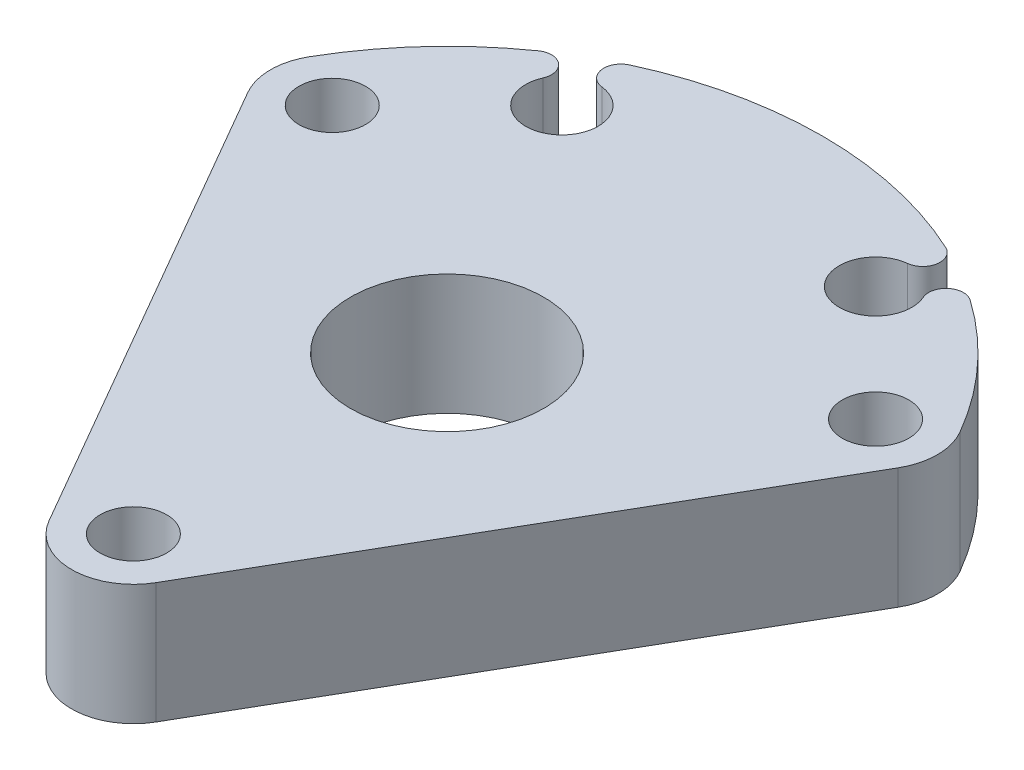
ISO-10303-21;
HEADER;
FILE_DESCRIPTION(('STEP AP214'),'2;1');
FILE_NAME('part.step','',(''),(''),'','','');
FILE_SCHEMA(('AUTOMOTIVE_DESIGN { 1 0 10303 214 1 1 1 1 }'));
ENDSEC;
DATA;
#1=APPLICATION_CONTEXT('core data for automotive mechanical design processes');
#2=APPLICATION_PROTOCOL_DEFINITION('international standard','automotive_design',2000,#1);
#3=PRODUCT_CONTEXT('',#1,'mechanical');
#4=PRODUCT('Part','Part','',(#3));
#5=PRODUCT_RELATED_PRODUCT_CATEGORY('part','',(#4));
#6=PRODUCT_DEFINITION_FORMATION('','',#4);
#7=PRODUCT_DEFINITION_CONTEXT('part definition',#1,'design');
#8=PRODUCT_DEFINITION('design','',#6,#7);
#9=PRODUCT_DEFINITION_SHAPE('','',#8);
#10=(LENGTH_UNIT() NAMED_UNIT(*) SI_UNIT(.MILLI.,.METRE.));
#11=(NAMED_UNIT(*) PLANE_ANGLE_UNIT() SI_UNIT($,.RADIAN.));
#12=(NAMED_UNIT(*) SI_UNIT($,.STERADIAN.) SOLID_ANGLE_UNIT());
#13=UNCERTAINTY_MEASURE_WITH_UNIT(LENGTH_MEASURE(1.E-05),#10,'distance_accuracy_value','');
#14=(GEOMETRIC_REPRESENTATION_CONTEXT(3) GLOBAL_UNCERTAINTY_ASSIGNED_CONTEXT((#13)) GLOBAL_UNIT_ASSIGNED_CONTEXT((#10,
#11,#12)) REPRESENTATION_CONTEXT('',''));
#15=CARTESIAN_POINT('',(0.,0.,0.));
#16=DIRECTION('',(0.,0.,1.));
#17=DIRECTION('',(1.,0.,0.));
#18=AXIS2_PLACEMENT_3D('',#15,#16,#17);
#19=CARTESIAN_POINT('',(0.,6.35,0.));
#20=DIRECTION('',(0.,-1.,0.));
#21=DIRECTION('',(0.,0.,-1.));
#22=AXIS2_PLACEMENT_3D('',#19,#20,#21);
#23=CYLINDRICAL_SURFACE('',#22,19.75);
#24=DIRECTION('',(0.,1.,0.));
#25=VECTOR('',#24,1.);
#26=CARTESIAN_POINT('',(-11.3545625208397,0.,-16.1597156522119));
#27=LINE('',#26,#25);
#28=CARTESIAN_POINT('',(-11.3545625208397,0.,-16.1597156522119));
#29=VERTEX_POINT('',#28);
#30=CARTESIAN_POINT('',(-11.3545625208397,6.35,-16.1597156522119));
#31=VERTEX_POINT('',#30);
#32=EDGE_CURVE('E148',#29,#31,#27,.T.);
#33=ORIENTED_EDGE('',*,*,#32,.F.);
#34=CARTESIAN_POINT('',(0.,0.,0.));
#35=DIRECTION('',(0.,1.,0.));
#36=DIRECTION('',(0.,0.,1.));
#37=AXIS2_PLACEMENT_3D('',#34,#35,#36);
#38=CIRCLE('',#37,19.75);
#39=CARTESIAN_POINT('',(-17.1040017247427,0.,-9.87500000000001));
#40=VERTEX_POINT('',#39);
#41=EDGE_CURVE('E162',#29,#40,#38,.T.);
#42=ORIENTED_EDGE('',*,*,#41,.T.);
#43=DIRECTION('',(0.,-1.,0.));
#44=VECTOR('',#43,1.);
#45=CARTESIAN_POINT('',(-17.1040017247427,6.35,-9.87500000000001));
#46=LINE('',#45,#44);
#47=CARTESIAN_POINT('',(-17.1040017247427,6.35,-9.87500000000001));
#48=VERTEX_POINT('',#47);
#49=EDGE_CURVE('E45',#48,#40,#46,.T.);
#50=ORIENTED_EDGE('',*,*,#49,.F.);
#51=CARTESIAN_POINT('',(0.,6.35,0.));
#52=DIRECTION('',(0.,1.,0.));
#53=DIRECTION('',(0.,0.,1.));
#54=AXIS2_PLACEMENT_3D('',#51,#52,#53);
#55=CIRCLE('',#54,19.75);
#56=EDGE_CURVE('E224',#31,#48,#55,.T.);
#57=ORIENTED_EDGE('',*,*,#56,.F.);
#58=EDGE_LOOP('',(#33,#42,#50,#57));
#59=FACE_BOUND('',#58,.T.);
#60=ADVANCED_FACE('F37',(#59),#23,.T.);
#61=CARTESIAN_POINT('',(8.3174430123287,0.,-17.9131974180118));
#62=VERTEX_POINT('',#61);
#63=CARTESIAN_POINT('',(-8.31744301232875,0.,-17.9131974180118));
#64=VERTEX_POINT('',#63);
#65=EDGE_CURVE('E154',#62,#64,#38,.T.);
#66=ORIENTED_EDGE('',*,*,#65,.T.);
#67=DIRECTION('',(0.,1.,0.));
#68=VECTOR('',#67,1.);
#69=CARTESIAN_POINT('',(-8.31744301232875,0.,-17.9131974180118));
#70=LINE('',#69,#68);
#71=CARTESIAN_POINT('',(-8.31744301232875,6.35,-17.9131974180118));
#72=VERTEX_POINT('',#71);
#73=EDGE_CURVE('E138',#64,#72,#70,.T.);
#74=ORIENTED_EDGE('',*,*,#73,.T.);
#75=CARTESIAN_POINT('',(8.3174430123287,6.35,-17.9131974180118));
#76=VERTEX_POINT('',#75);
#77=EDGE_CURVE('E223',#76,#72,#55,.T.);
#78=ORIENTED_EDGE('',*,*,#77,.F.);
#79=DIRECTION('',(0.,1.,0.));
#80=VECTOR('',#79,1.);
#81=CARTESIAN_POINT('',(8.3174430123287,0.,-17.9131974180118));
#82=LINE('',#81,#80);
#83=EDGE_CURVE('E160',#62,#76,#82,.T.);
#84=ORIENTED_EDGE('',*,*,#83,.F.);
#85=EDGE_LOOP('',(#66,#74,#78,#84));
#86=FACE_BOUND('',#85,.T.);
#87=ADVANCED_FACE('F159',(#86),#23,.T.);
#88=CARTESIAN_POINT('',(14.2894191624432,6.35,-8.25));
#89=DIRECTION('',(0.,1.,0.));
#90=DIRECTION('',(0.,0.,1.));
#91=AXIS2_PLACEMENT_3D('',#88,#89,#90);
#92=PLANE('',#91);
#93=CARTESIAN_POINT('',(-7.93394264831238,6.35,-17.0872563541149));
#94=DIRECTION('',(0.,-1.,0.));
#95=DIRECTION('',(0.86602540378444,0.,0.499999999999998));
#96=AXIS2_PLACEMENT_3D('',#93,#94,#95);
#97=CIRCLE('',#96,0.910632291450181);
#98=CARTESIAN_POINT('',(-8.03616197264354,6.35,-16.1823793569683));
#99=VERTEX_POINT('',#98);
#100=EDGE_CURVE('E143',#99,#72,#97,.T.);
#101=ORIENTED_EDGE('',*,*,#100,.F.);
#102=CARTESIAN_POINT('',(-8.25000000000003,6.35,-14.2894191624432));
#103=DIRECTION('',(0.,1.,0.));
#104=DIRECTION('',(0.86602540378444,0.,0.499999999999998));
#105=AXIS2_PLACEMENT_3D('',#102,#103,#104);
#106=CIRCLE('',#105,1.905);
#107=CARTESIAN_POINT('',(-9.99627063048971,6.35,-15.0507100957199));
#108=VERTEX_POINT('',#107);
#109=EDGE_CURVE('E157',#108,#99,#106,.T.);
#110=ORIENTED_EDGE('',*,*,#109,.F.);
#111=CARTESIAN_POINT('',(-10.8310267594844,6.35,-15.4146240626647));
#112=DIRECTION('',(0.,-1.,0.));
#113=DIRECTION('',(-0.86602540378444,0.,-0.499999999999998));
#114=AXIS2_PLACEMENT_3D('',#111,#112,#113);
#115=CIRCLE('',#114,0.910632291450179);
#116=EDGE_CURVE('E281',#31,#108,#115,.T.);
#117=ORIENTED_EDGE('',*,*,#116,.F.);
#118=ORIENTED_EDGE('',*,*,#56,.T.);
#119=CARTESIAN_POINT('',(-14.2894191624432,6.35,-8.25));
#120=DIRECTION('',(0.,1.,0.));
#121=DIRECTION('',(0.,0.,1.));
#122=AXIS2_PLACEMENT_3D('',#119,#120,#121);
#123=CIRCLE('',#122,3.25);
#124=CARTESIAN_POINT('',(-17.1040017247427,6.35,-6.625));
#125=VERTEX_POINT('',#124);
#126=EDGE_CURVE('E197',#48,#125,#123,.T.);
#127=ORIENTED_EDGE('',*,*,#126,.T.);
#128=DIRECTION('',(0.5,0.,0.866025403784438));
#129=VECTOR('',#128,1.);
#130=CARTESIAN_POINT('',(-17.1040017247427,6.35,-6.625));
#131=LINE('',#130,#129);
#132=CARTESIAN_POINT('',(-2.81458256229942,6.35,18.125));
#133=VERTEX_POINT('',#132);
#134=EDGE_CURVE('E215',#125,#133,#131,.T.);
#135=ORIENTED_EDGE('',*,*,#134,.T.);
#136=CARTESIAN_POINT('',(0.,6.35,16.5));
#137=DIRECTION('',(0.,1.,0.));
#138=DIRECTION('',(0.,0.,1.));
#139=AXIS2_PLACEMENT_3D('',#136,#137,#138);
#140=CIRCLE('',#139,3.25);
#141=CARTESIAN_POINT('',(2.81458256229942,6.35,18.125));
#142=VERTEX_POINT('',#141);
#143=EDGE_CURVE('E212',#133,#142,#140,.T.);
#144=ORIENTED_EDGE('',*,*,#143,.T.);
#145=DIRECTION('',(0.5,0.,-0.866025403784438));
#146=VECTOR('',#145,1.);
#147=CARTESIAN_POINT('',(2.81458256229942,6.35,18.125));
#148=LINE('',#147,#146);
#149=CARTESIAN_POINT('',(17.1040017247427,6.35,-6.625));
#150=VERTEX_POINT('',#149);
#151=EDGE_CURVE('E182',#142,#150,#148,.T.);
#152=ORIENTED_EDGE('',*,*,#151,.T.);
#153=CARTESIAN_POINT('',(14.2894191624432,6.35,-8.25));
#154=DIRECTION('',(0.,1.,0.));
#155=DIRECTION('',(0.,0.,1.));
#156=AXIS2_PLACEMENT_3D('',#153,#154,#155);
#157=CIRCLE('',#156,3.25);
#158=CARTESIAN_POINT('',(17.1040017247427,6.35,-9.875));
#159=VERTEX_POINT('',#158);
#160=EDGE_CURVE('E177',#150,#159,#157,.T.);
#161=ORIENTED_EDGE('',*,*,#160,.T.);
#162=CARTESIAN_POINT('',(11.3545625208397,6.35,-16.1597156522119));
#163=VERTEX_POINT('',#162);
#164=EDGE_CURVE('E220',#159,#163,#55,.T.);
#165=ORIENTED_EDGE('',*,*,#164,.T.);
#166=CARTESIAN_POINT('',(10.8310267594844,6.35,-15.4146240626647));
#167=DIRECTION('',(0.,-1.,0.));
#168=DIRECTION('',(0.,0.,1.));
#169=AXIS2_PLACEMENT_3D('',#166,#167,#168);
#170=CIRCLE('',#169,0.910632291450181);
#171=CARTESIAN_POINT('',(9.99627063048967,6.35,-15.0507100957199));
#172=VERTEX_POINT('',#171);
#173=EDGE_CURVE('E267',#172,#163,#170,.T.);
#174=ORIENTED_EDGE('',*,*,#173,.F.);
#175=CARTESIAN_POINT('',(8.25,6.35,-14.2894191624432));
#176=DIRECTION('',(0.,1.,0.));
#177=DIRECTION('',(0.,0.,1.));
#178=AXIS2_PLACEMENT_3D('',#175,#176,#177);
#179=CIRCLE('',#178,1.905);
#180=CARTESIAN_POINT('',(8.03616197264349,6.35,-16.1823793569683));
#181=VERTEX_POINT('',#180);
#182=EDGE_CURVE('E260',#181,#172,#179,.T.);
#183=ORIENTED_EDGE('',*,*,#182,.F.);
#184=CARTESIAN_POINT('',(7.93394264831234,6.35,-17.0872563541149));
#185=DIRECTION('',(0.,-1.,0.));
#186=DIRECTION('',(0.,0.,-1.));
#187=AXIS2_PLACEMENT_3D('',#184,#185,#186);
#188=CIRCLE('',#187,0.910632291450179);
#189=EDGE_CURVE('E264',#76,#181,#188,.T.);
#190=ORIENTED_EDGE('',*,*,#189,.F.);
#191=ORIENTED_EDGE('',*,*,#77,.T.);
#192=EDGE_LOOP('',(#101,#110,#117,#118,#127,#135,#144,#152,#161,#165,#174,#183,#190,#191));
#193=FACE_BOUND('',#192,.T.);
#194=CARTESIAN_POINT('',(0.,6.35,16.5));
#195=DIRECTION('',(0.,1.,0.));
#196=DIRECTION('',(0.,0.,1.));
#197=AXIS2_PLACEMENT_3D('',#194,#195,#196);
#198=CIRCLE('',#197,1.75);
#199=CARTESIAN_POINT('',(0.,6.35,18.25));
#200=VERTEX_POINT('',#199);
#201=EDGE_CURVE('E237',#200,#200,#198,.T.);
#202=ORIENTED_EDGE('',*,*,#201,.F.);
#203=EDGE_LOOP('',(#202));
#204=FACE_BOUND('',#203,.T.);
#205=CARTESIAN_POINT('',(0.,6.35,0.));
#206=DIRECTION('',(0.,1.,0.));
#207=DIRECTION('',(0.,0.,1.));
#208=AXIS2_PLACEMENT_3D('',#205,#206,#207);
#209=CIRCLE('',#208,5.08);
#210=CARTESIAN_POINT('',(0.,6.35,5.08));
#211=VERTEX_POINT('',#210);
#212=EDGE_CURVE('E230',#211,#211,#209,.T.);
#213=ORIENTED_EDGE('',*,*,#212,.F.);
#214=EDGE_LOOP('',(#213));
#215=FACE_BOUND('',#214,.T.);
#216=CARTESIAN_POINT('',(-14.2894191624432,6.35,-8.25));
#217=DIRECTION('',(0.,1.,0.));
#218=DIRECTION('',(0.,0.,1.));
#219=AXIS2_PLACEMENT_3D('',#216,#217,#218);
#220=CIRCLE('',#219,1.75);
#221=CARTESIAN_POINT('',(-14.2894191624432,6.35,-6.5));
#222=VERTEX_POINT('',#221);
#223=EDGE_CURVE('E231',#222,#222,#220,.T.);
#224=ORIENTED_EDGE('',*,*,#223,.F.);
#225=EDGE_LOOP('',(#224));
#226=FACE_BOUND('',#225,.T.);
#227=CARTESIAN_POINT('',(14.2894191624432,6.35,-8.25));
#228=DIRECTION('',(0.,1.,0.));
#229=DIRECTION('',(0.,0.,1.));
#230=AXIS2_PLACEMENT_3D('',#227,#228,#229);
#231=CIRCLE('',#230,1.75);
#232=CARTESIAN_POINT('',(14.2894191624432,6.35,-6.5));
#233=VERTEX_POINT('',#232);
#234=EDGE_CURVE('E243',#233,#233,#231,.T.);
#235=ORIENTED_EDGE('',*,*,#234,.F.);
#236=EDGE_LOOP('',(#235));
#237=FACE_BOUND('',#236,.T.);
#238=ADVANCED_FACE('F291',(#193,#204,#215,#226,#237),#92,.T.);
#239=CARTESIAN_POINT('',(14.2894191624432,0.,-8.25));
#240=DIRECTION('',(0.,1.,0.));
#241=DIRECTION('',(0.,0.,1.));
#242=AXIS2_PLACEMENT_3D('',#239,#240,#241);
#243=PLANE('',#242);
#244=CARTESIAN_POINT('',(0.,0.,16.5));
#245=DIRECTION('',(0.,1.,0.));
#246=DIRECTION('',(0.,0.,1.));
#247=AXIS2_PLACEMENT_3D('',#244,#245,#246);
#248=CIRCLE('',#247,1.75);
#249=CARTESIAN_POINT('',(0.,0.,18.25));
#250=VERTEX_POINT('',#249);
#251=EDGE_CURVE('E240',#250,#250,#248,.T.);
#252=ORIENTED_EDGE('',*,*,#251,.T.);
#253=EDGE_LOOP('',(#252));
#254=FACE_BOUND('',#253,.T.);
#255=CARTESIAN_POINT('',(0.,0.,0.));
#256=DIRECTION('',(0.,1.,0.));
#257=DIRECTION('',(0.,0.,1.));
#258=AXIS2_PLACEMENT_3D('',#255,#256,#257);
#259=CIRCLE('',#258,5.08);
#260=CARTESIAN_POINT('',(0.,0.,5.08));
#261=VERTEX_POINT('',#260);
#262=EDGE_CURVE('E227',#261,#261,#259,.T.);
#263=ORIENTED_EDGE('',*,*,#262,.T.);
#264=EDGE_LOOP('',(#263));
#265=FACE_BOUND('',#264,.T.);
#266=CARTESIAN_POINT('',(-8.25000000000003,0.,-14.2894191624432));
#267=DIRECTION('',(0.,1.,0.));
#268=DIRECTION('',(0.86602540378444,0.,0.499999999999998));
#269=AXIS2_PLACEMENT_3D('',#266,#267,#268);
#270=CIRCLE('',#269,1.905);
#271=CARTESIAN_POINT('',(-9.99627063048971,0.,-15.0507100957199));
#272=VERTEX_POINT('',#271);
#273=CARTESIAN_POINT('',(-8.03616197264354,0.,-16.1823793569683));
#274=VERTEX_POINT('',#273);
#275=EDGE_CURVE('E52',#272,#274,#270,.T.);
#276=ORIENTED_EDGE('',*,*,#275,.T.);
#277=CARTESIAN_POINT('',(-7.93394264831238,0.,-17.0872563541149));
#278=DIRECTION('',(0.,-1.,0.));
#279=DIRECTION('',(0.86602540378444,0.,0.499999999999998));
#280=AXIS2_PLACEMENT_3D('',#277,#278,#279);
#281=CIRCLE('',#280,0.910632291450181);
#282=EDGE_CURVE('E141',#274,#64,#281,.T.);
#283=ORIENTED_EDGE('',*,*,#282,.T.);
#284=ORIENTED_EDGE('',*,*,#65,.F.);
#285=CARTESIAN_POINT('',(7.93394264831234,0.,-17.0872563541149));
#286=DIRECTION('',(0.,-1.,0.));
#287=DIRECTION('',(0.,0.,-1.));
#288=AXIS2_PLACEMENT_3D('',#285,#286,#287);
#289=CIRCLE('',#288,0.910632291450179);
#290=CARTESIAN_POINT('',(8.03616197264349,0.,-16.1823793569683));
#291=VERTEX_POINT('',#290);
#292=EDGE_CURVE('E60',#62,#291,#289,.T.);
#293=ORIENTED_EDGE('',*,*,#292,.T.);
#294=CARTESIAN_POINT('',(8.25,0.,-14.2894191624432));
#295=DIRECTION('',(0.,1.,0.));
#296=DIRECTION('',(0.,0.,1.));
#297=AXIS2_PLACEMENT_3D('',#294,#295,#296);
#298=CIRCLE('',#297,1.905);
#299=CARTESIAN_POINT('',(9.99627063048967,0.,-15.0507100957199));
#300=VERTEX_POINT('',#299);
#301=EDGE_CURVE('E255',#291,#300,#298,.T.);
#302=ORIENTED_EDGE('',*,*,#301,.T.);
#303=CARTESIAN_POINT('',(10.8310267594844,0.,-15.4146240626647));
#304=DIRECTION('',(0.,-1.,0.));
#305=DIRECTION('',(0.,0.,1.));
#306=AXIS2_PLACEMENT_3D('',#303,#304,#305);
#307=CIRCLE('',#306,0.910632291450181);
#308=CARTESIAN_POINT('',(11.3545625208397,0.,-16.1597156522119));
#309=VERTEX_POINT('',#308);
#310=EDGE_CURVE('E263',#300,#309,#307,.T.);
#311=ORIENTED_EDGE('',*,*,#310,.T.);
#312=CARTESIAN_POINT('',(17.1040017247427,0.,-9.875));
#313=VERTEX_POINT('',#312);
#314=EDGE_CURVE('E161',#313,#309,#38,.T.);
#315=ORIENTED_EDGE('',*,*,#314,.F.);
#316=CARTESIAN_POINT('',(14.2894191624432,0.,-8.25));
#317=DIRECTION('',(0.,1.,0.));
#318=DIRECTION('',(0.,0.,1.));
#319=AXIS2_PLACEMENT_3D('',#316,#317,#318);
#320=CIRCLE('',#319,3.25);
#321=CARTESIAN_POINT('',(17.1040017247427,0.,-6.625));
#322=VERTEX_POINT('',#321);
#323=EDGE_CURVE('E166',#322,#313,#320,.T.);
#324=ORIENTED_EDGE('',*,*,#323,.F.);
#325=DIRECTION('',(0.5,0.,-0.866025403784438));
#326=VECTOR('',#325,1.);
#327=CARTESIAN_POINT('',(2.81458256229942,0.,18.125));
#328=LINE('',#327,#326);
#329=CARTESIAN_POINT('',(2.81458256229942,0.,18.125));
#330=VERTEX_POINT('',#329);
#331=EDGE_CURVE('E175',#330,#322,#328,.T.);
#332=ORIENTED_EDGE('',*,*,#331,.F.);
#333=CARTESIAN_POINT('',(0.,0.,16.5));
#334=DIRECTION('',(0.,1.,0.));
#335=DIRECTION('',(0.,0.,1.));
#336=AXIS2_PLACEMENT_3D('',#333,#334,#335);
#337=CIRCLE('',#336,3.25);
#338=CARTESIAN_POINT('',(-2.81458256229942,0.,18.125));
#339=VERTEX_POINT('',#338);
#340=EDGE_CURVE('E173',#339,#330,#337,.T.);
#341=ORIENTED_EDGE('',*,*,#340,.F.);
#342=DIRECTION('',(0.5,0.,0.866025403784438));
#343=VECTOR('',#342,1.);
#344=CARTESIAN_POINT('',(-17.1040017247427,0.,-6.625));
#345=LINE('',#344,#343);
#346=CARTESIAN_POINT('',(-17.1040017247427,0.,-6.625));
#347=VERTEX_POINT('',#346);
#348=EDGE_CURVE('E171',#347,#339,#345,.T.);
#349=ORIENTED_EDGE('',*,*,#348,.F.);
#350=CARTESIAN_POINT('',(-14.2894191624432,0.,-8.25));
#351=DIRECTION('',(0.,1.,0.));
#352=DIRECTION('',(0.,0.,1.));
#353=AXIS2_PLACEMENT_3D('',#350,#351,#352);
#354=CIRCLE('',#353,3.25);
#355=EDGE_CURVE('E165',#40,#347,#354,.T.);
#356=ORIENTED_EDGE('',*,*,#355,.F.);
#357=ORIENTED_EDGE('',*,*,#41,.F.);
#358=CARTESIAN_POINT('',(-10.8310267594844,0.,-15.4146240626647));
#359=DIRECTION('',(0.,-1.,0.));
#360=DIRECTION('',(-0.86602540378444,0.,-0.499999999999998));
#361=AXIS2_PLACEMENT_3D('',#358,#359,#360);
#362=CIRCLE('',#361,0.910632291450179);
#363=EDGE_CURVE('E156',#29,#272,#362,.T.);
#364=ORIENTED_EDGE('',*,*,#363,.T.);
#365=EDGE_LOOP('',(#276,#283,#284,#293,#302,#311,#315,#324,#332,#341,#349,#356,#357,#364));
#366=FACE_BOUND('',#365,.T.);
#367=CARTESIAN_POINT('',(-14.2894191624432,0.,-8.25));
#368=DIRECTION('',(0.,1.,0.));
#369=DIRECTION('',(0.,0.,1.));
#370=AXIS2_PLACEMENT_3D('',#367,#368,#369);
#371=CIRCLE('',#370,1.75);
#372=CARTESIAN_POINT('',(-14.2894191624432,0.,-6.5));
#373=VERTEX_POINT('',#372);
#374=EDGE_CURVE('E234',#373,#373,#371,.T.);
#375=ORIENTED_EDGE('',*,*,#374,.T.);
#376=EDGE_LOOP('',(#375));
#377=FACE_BOUND('',#376,.T.);
#378=CARTESIAN_POINT('',(14.2894191624432,0.,-8.25));
#379=DIRECTION('',(0.,1.,0.));
#380=DIRECTION('',(0.,0.,1.));
#381=AXIS2_PLACEMENT_3D('',#378,#379,#380);
#382=CIRCLE('',#381,1.75);
#383=CARTESIAN_POINT('',(14.2894191624432,0.,-6.5));
#384=VERTEX_POINT('',#383);
#385=EDGE_CURVE('E246',#384,#384,#382,.T.);
#386=ORIENTED_EDGE('',*,*,#385,.T.);
#387=EDGE_LOOP('',(#386));
#388=FACE_BOUND('',#387,.T.);
#389=ADVANCED_FACE('F152',(#254,#265,#366,#377,#388),#243,.F.);
#390=CARTESIAN_POINT('',(14.2894191624432,6.35,-8.25));
#391=DIRECTION('',(0.,-1.,0.));
#392=DIRECTION('',(0.,0.,-1.));
#393=AXIS2_PLACEMENT_3D('',#390,#391,#392);
#394=CYLINDRICAL_SURFACE('',#393,3.25);
#395=ORIENTED_EDGE('',*,*,#323,.T.);
#396=DIRECTION('',(0.,-1.,0.));
#397=VECTOR('',#396,1.);
#398=CARTESIAN_POINT('',(17.1040017247427,6.35,-9.875));
#399=LINE('',#398,#397);
#400=EDGE_CURVE('E11',#159,#313,#399,.T.);
#401=ORIENTED_EDGE('',*,*,#400,.F.);
#402=ORIENTED_EDGE('',*,*,#160,.F.);
#403=DIRECTION('',(0.,-1.,0.));
#404=VECTOR('',#403,1.);
#405=CARTESIAN_POINT('',(17.1040017247427,6.35,-6.625));
#406=LINE('',#405,#404);
#407=EDGE_CURVE('E178',#150,#322,#406,.T.);
#408=ORIENTED_EDGE('',*,*,#407,.T.);
#409=EDGE_LOOP('',(#395,#401,#402,#408));
#410=FACE_BOUND('',#409,.T.);
#411=ADVANCED_FACE('F39',(#410),#394,.T.);
#412=ORIENTED_EDGE('',*,*,#314,.T.);
#413=DIRECTION('',(0.,1.,0.));
#414=VECTOR('',#413,1.);
#415=CARTESIAN_POINT('',(11.3545625208397,0.,-16.1597156522119));
#416=LINE('',#415,#414);
#417=EDGE_CURVE('E252',#309,#163,#416,.T.);
#418=ORIENTED_EDGE('',*,*,#417,.T.);
#419=ORIENTED_EDGE('',*,*,#164,.F.);
#420=ORIENTED_EDGE('',*,*,#400,.T.);
#421=EDGE_LOOP('',(#412,#418,#419,#420));
#422=FACE_BOUND('',#421,.T.);
#423=ADVANCED_FACE('F304',(#422),#23,.T.);
#424=CARTESIAN_POINT('',(-14.2894191624432,6.35,-8.25));
#425=DIRECTION('',(0.,-1.,0.));
#426=DIRECTION('',(0.,0.,-1.));
#427=AXIS2_PLACEMENT_3D('',#424,#425,#426);
#428=CYLINDRICAL_SURFACE('',#427,3.25);
#429=ORIENTED_EDGE('',*,*,#355,.T.);
#430=DIRECTION('',(0.,-1.,0.));
#431=VECTOR('',#430,1.);
#432=CARTESIAN_POINT('',(-17.1040017247427,6.35,-6.625));
#433=LINE('',#432,#431);
#434=EDGE_CURVE('E188',#125,#347,#433,.T.);
#435=ORIENTED_EDGE('',*,*,#434,.F.);
#436=ORIENTED_EDGE('',*,*,#126,.F.);
#437=ORIENTED_EDGE('',*,*,#49,.T.);
#438=EDGE_LOOP('',(#429,#435,#436,#437));
#439=FACE_BOUND('',#438,.T.);
#440=ADVANCED_FACE('F195',(#439),#428,.T.);
#441=CARTESIAN_POINT('',(-17.1040017247427,6.35,-6.625));
#442=DIRECTION('',(0.866025403784438,0.,-0.5));
#443=DIRECTION('',(-0.5,0.,-0.866025403784439));
#444=AXIS2_PLACEMENT_3D('',#441,#442,#443);
#445=PLANE('',#444);
#446=ORIENTED_EDGE('',*,*,#348,.T.);
#447=DIRECTION('',(0.,-1.,0.));
#448=VECTOR('',#447,1.);
#449=CARTESIAN_POINT('',(-2.81458256229942,6.35,18.125));
#450=LINE('',#449,#448);
#451=EDGE_CURVE('E185',#133,#339,#450,.T.);
#452=ORIENTED_EDGE('',*,*,#451,.F.);
#453=ORIENTED_EDGE('',*,*,#134,.F.);
#454=ORIENTED_EDGE('',*,*,#434,.T.);
#455=EDGE_LOOP('',(#446,#452,#453,#454));
#456=FACE_BOUND('',#455,.T.);
#457=ADVANCED_FACE('F206',(#456),#445,.F.);
#458=CARTESIAN_POINT('',(0.,6.35,16.5));
#459=DIRECTION('',(0.,-1.,0.));
#460=DIRECTION('',(0.,0.,-1.));
#461=AXIS2_PLACEMENT_3D('',#458,#459,#460);
#462=CYLINDRICAL_SURFACE('',#461,3.25);
#463=ORIENTED_EDGE('',*,*,#340,.T.);
#464=DIRECTION('',(0.,-1.,0.));
#465=VECTOR('',#464,1.);
#466=CARTESIAN_POINT('',(2.81458256229942,6.35,18.125));
#467=LINE('',#466,#465);
#468=EDGE_CURVE('E181',#142,#330,#467,.T.);
#469=ORIENTED_EDGE('',*,*,#468,.F.);
#470=ORIENTED_EDGE('',*,*,#143,.F.);
#471=ORIENTED_EDGE('',*,*,#451,.T.);
#472=EDGE_LOOP('',(#463,#469,#470,#471));
#473=FACE_BOUND('',#472,.T.);
#474=ADVANCED_FACE('F210',(#473),#462,.T.);
#475=CARTESIAN_POINT('',(2.81458256229942,6.35,18.125));
#476=DIRECTION('',(-0.866025403784438,0.,-0.5));
#477=DIRECTION('',(-0.5,0.,0.866025403784439));
#478=AXIS2_PLACEMENT_3D('',#475,#476,#477);
#479=PLANE('',#478);
#480=ORIENTED_EDGE('',*,*,#331,.T.);
#481=ORIENTED_EDGE('',*,*,#407,.F.);
#482=ORIENTED_EDGE('',*,*,#151,.F.);
#483=ORIENTED_EDGE('',*,*,#468,.T.);
#484=EDGE_LOOP('',(#480,#481,#482,#483));
#485=FACE_BOUND('',#484,.T.);
#486=ADVANCED_FACE('F311',(#485),#479,.F.);
#487=CARTESIAN_POINT('',(0.,6.35,0.));
#488=DIRECTION('',(0.,-1.,0.));
#489=DIRECTION('',(0.,0.,-1.));
#490=AXIS2_PLACEMENT_3D('',#487,#488,#489);
#491=CYLINDRICAL_SURFACE('',#490,5.08);
#492=ORIENTED_EDGE('',*,*,#212,.T.);
#493=EDGE_LOOP('',(#492));
#494=FACE_BOUND('',#493,.T.);
#495=ORIENTED_EDGE('',*,*,#262,.F.);
#496=EDGE_LOOP('',(#495));
#497=FACE_BOUND('',#496,.T.);
#498=ADVANCED_FACE('F349',(#494,#497),#491,.F.);
#499=CARTESIAN_POINT('',(-14.2894191624432,6.35,-8.25));
#500=DIRECTION('',(0.,-1.,0.));
#501=DIRECTION('',(0.,0.,-1.));
#502=AXIS2_PLACEMENT_3D('',#499,#500,#501);
#503=CYLINDRICAL_SURFACE('',#502,1.75);
#504=ORIENTED_EDGE('',*,*,#223,.T.);
#505=EDGE_LOOP('',(#504));
#506=FACE_BOUND('',#505,.T.);
#507=ORIENTED_EDGE('',*,*,#374,.F.);
#508=EDGE_LOOP('',(#507));
#509=FACE_BOUND('',#508,.T.);
#510=ADVANCED_FACE('F371',(#506,#509),#503,.F.);
#511=CARTESIAN_POINT('',(0.,6.35,16.5));
#512=DIRECTION('',(0.,-1.,0.));
#513=DIRECTION('',(0.,0.,-1.));
#514=AXIS2_PLACEMENT_3D('',#511,#512,#513);
#515=CYLINDRICAL_SURFACE('',#514,1.75);
#516=ORIENTED_EDGE('',*,*,#201,.T.);
#517=EDGE_LOOP('',(#516));
#518=FACE_BOUND('',#517,.T.);
#519=ORIENTED_EDGE('',*,*,#251,.F.);
#520=EDGE_LOOP('',(#519));
#521=FACE_BOUND('',#520,.T.);
#522=ADVANCED_FACE('F321',(#518,#521),#515,.F.);
#523=CARTESIAN_POINT('',(14.2894191624432,6.35,-8.25));
#524=DIRECTION('',(0.,-1.,0.));
#525=DIRECTION('',(0.,0.,-1.));
#526=AXIS2_PLACEMENT_3D('',#523,#524,#525);
#527=CYLINDRICAL_SURFACE('',#526,1.75);
#528=ORIENTED_EDGE('',*,*,#234,.T.);
#529=EDGE_LOOP('',(#528));
#530=FACE_BOUND('',#529,.T.);
#531=ORIENTED_EDGE('',*,*,#385,.F.);
#532=EDGE_LOOP('',(#531));
#533=FACE_BOUND('',#532,.T.);
#534=ADVANCED_FACE('F314',(#530,#533),#527,.F.);
#535=CARTESIAN_POINT('',(10.8310267594844,0.,-15.4146240626647));
#536=DIRECTION('',(0.,1.,0.));
#537=DIRECTION('',(0.,0.,1.));
#538=AXIS2_PLACEMENT_3D('',#535,#536,#537);
#539=CYLINDRICAL_SURFACE('',#538,0.910632291450181);
#540=ORIENTED_EDGE('',*,*,#173,.T.);
#541=ORIENTED_EDGE('',*,*,#417,.F.);
#542=ORIENTED_EDGE('',*,*,#310,.F.);
#543=DIRECTION('',(0.,1.,0.));
#544=VECTOR('',#543,1.);
#545=CARTESIAN_POINT('',(9.99627063048967,0.,-15.0507100957199));
#546=LINE('',#545,#544);
#547=EDGE_CURVE('E249',#300,#172,#546,.T.);
#548=ORIENTED_EDGE('',*,*,#547,.T.);
#549=EDGE_LOOP('',(#540,#541,#542,#548));
#550=FACE_BOUND('',#549,.T.);
#551=ADVANCED_FACE('F312',(#550),#539,.T.);
#552=CARTESIAN_POINT('',(8.25,0.,-14.2894191624432));
#553=DIRECTION('',(0.,1.,0.));
#554=DIRECTION('',(0.,0.,1.));
#555=AXIS2_PLACEMENT_3D('',#552,#553,#554);
#556=CYLINDRICAL_SURFACE('',#555,1.905);
#557=ORIENTED_EDGE('',*,*,#182,.T.);
#558=ORIENTED_EDGE('',*,*,#547,.F.);
#559=ORIENTED_EDGE('',*,*,#301,.F.);
#560=DIRECTION('',(0.,1.,0.));
#561=VECTOR('',#560,1.);
#562=CARTESIAN_POINT('',(8.03616197264349,0.,-16.1823793569683));
#563=LINE('',#562,#561);
#564=EDGE_CURVE('E257',#291,#181,#563,.T.);
#565=ORIENTED_EDGE('',*,*,#564,.T.);
#566=EDGE_LOOP('',(#557,#558,#559,#565));
#567=FACE_BOUND('',#566,.T.);
#568=ADVANCED_FACE('F299',(#567),#556,.F.);
#569=CARTESIAN_POINT('',(7.93394264831234,0.,-17.0872563541149));
#570=DIRECTION('',(0.,1.,0.));
#571=DIRECTION('',(0.,0.,1.));
#572=AXIS2_PLACEMENT_3D('',#569,#570,#571);
#573=CYLINDRICAL_SURFACE('',#572,0.910632291450179);
#574=ORIENTED_EDGE('',*,*,#189,.T.);
#575=ORIENTED_EDGE('',*,*,#564,.F.);
#576=ORIENTED_EDGE('',*,*,#292,.F.);
#577=ORIENTED_EDGE('',*,*,#83,.T.);
#578=EDGE_LOOP('',(#574,#575,#576,#577));
#579=FACE_BOUND('',#578,.T.);
#580=ADVANCED_FACE('F296',(#579),#573,.T.);
#581=CARTESIAN_POINT('',(-7.93394264831238,0.,-17.0872563541149));
#582=DIRECTION('',(0.,1.,0.));
#583=DIRECTION('',(0.,0.,1.));
#584=AXIS2_PLACEMENT_3D('',#581,#582,#583);
#585=CYLINDRICAL_SURFACE('',#584,0.910632291450181);
#586=ORIENTED_EDGE('',*,*,#100,.T.);
#587=ORIENTED_EDGE('',*,*,#73,.F.);
#588=ORIENTED_EDGE('',*,*,#282,.F.);
#589=DIRECTION('',(0.,1.,0.));
#590=VECTOR('',#589,1.);
#591=CARTESIAN_POINT('',(-8.03616197264354,0.,-16.1823793569683));
#592=LINE('',#591,#590);
#593=EDGE_CURVE('E269',#274,#99,#592,.T.);
#594=ORIENTED_EDGE('',*,*,#593,.T.);
#595=EDGE_LOOP('',(#586,#587,#588,#594));
#596=FACE_BOUND('',#595,.T.);
#597=ADVANCED_FACE('F140',(#596),#585,.T.);
#598=CARTESIAN_POINT('',(-8.25000000000003,0.,-14.2894191624432));
#599=DIRECTION('',(0.,1.,0.));
#600=DIRECTION('',(0.,0.,1.));
#601=AXIS2_PLACEMENT_3D('',#598,#599,#600);
#602=CYLINDRICAL_SURFACE('',#601,1.905);
#603=ORIENTED_EDGE('',*,*,#109,.T.);
#604=ORIENTED_EDGE('',*,*,#593,.F.);
#605=ORIENTED_EDGE('',*,*,#275,.F.);
#606=DIRECTION('',(0.,1.,0.));
#607=VECTOR('',#606,1.);
#608=CARTESIAN_POINT('',(-9.99627063048971,0.,-15.0507100957199));
#609=LINE('',#608,#607);
#610=EDGE_CURVE('E276',#272,#108,#609,.T.);
#611=ORIENTED_EDGE('',*,*,#610,.T.);
#612=EDGE_LOOP('',(#603,#604,#605,#611));
#613=FACE_BOUND('',#612,.T.);
#614=ADVANCED_FACE('F442',(#613),#602,.F.);
#615=CARTESIAN_POINT('',(-10.8310267594844,0.,-15.4146240626647));
#616=DIRECTION('',(0.,1.,0.));
#617=DIRECTION('',(0.,0.,1.));
#618=AXIS2_PLACEMENT_3D('',#615,#616,#617);
#619=CYLINDRICAL_SURFACE('',#618,0.910632291450179);
#620=ORIENTED_EDGE('',*,*,#116,.T.);
#621=ORIENTED_EDGE('',*,*,#610,.F.);
#622=ORIENTED_EDGE('',*,*,#363,.F.);
#623=ORIENTED_EDGE('',*,*,#32,.T.);
#624=EDGE_LOOP('',(#620,#621,#622,#623));
#625=FACE_BOUND('',#624,.T.);
#626=ADVANCED_FACE('F288',(#625),#619,.T.);
#627=CLOSED_SHELL('',(#60,#87,#238,#389,#411,#423,#440,#457,#474,#486,#498,#510,#522,#534,#551,
#568,#580,#597,#614,#626));
#628=MANIFOLD_SOLID_BREP('B2',#627);
#629=ADVANCED_BREP_SHAPE_REPRESENTATION('',(#18,#628),#14);
#630=SHAPE_DEFINITION_REPRESENTATION(#9,#629);
ENDSEC;
END-ISO-10303-21;
